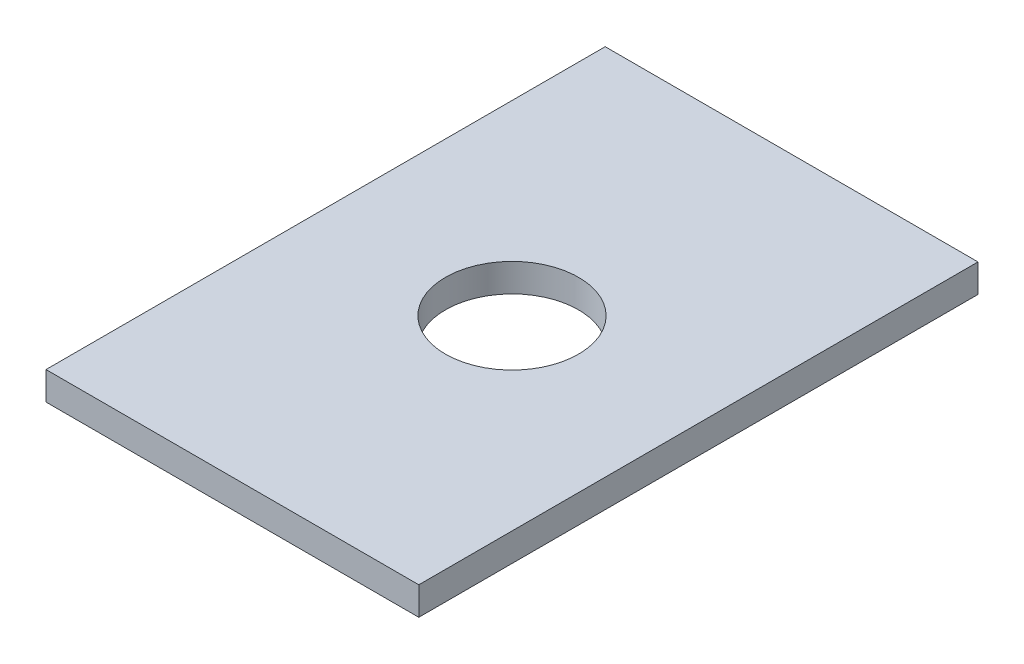
ISO-10303-21;
HEADER;
FILE_DESCRIPTION(('STEP AP214'),'2;1');
FILE_NAME('part.step','',(''),(''),'','','');
FILE_SCHEMA(('AUTOMOTIVE_DESIGN { 1 0 10303 214 1 1 1 1 }'));
ENDSEC;
DATA;
#1=APPLICATION_CONTEXT('core data for automotive mechanical design processes');
#2=APPLICATION_PROTOCOL_DEFINITION('international standard','automotive_design',2000,#1);
#3=PRODUCT_CONTEXT('',#1,'mechanical');
#4=PRODUCT('Part','Part','',(#3));
#5=PRODUCT_RELATED_PRODUCT_CATEGORY('part','',(#4));
#6=PRODUCT_DEFINITION_FORMATION('','',#4);
#7=PRODUCT_DEFINITION_CONTEXT('part definition',#1,'design');
#8=PRODUCT_DEFINITION('design','',#6,#7);
#9=PRODUCT_DEFINITION_SHAPE('','',#8);
#10=(LENGTH_UNIT() NAMED_UNIT(*) SI_UNIT(.MILLI.,.METRE.));
#11=(NAMED_UNIT(*) PLANE_ANGLE_UNIT() SI_UNIT($,.RADIAN.));
#12=(NAMED_UNIT(*) SI_UNIT($,.STERADIAN.) SOLID_ANGLE_UNIT());
#13=UNCERTAINTY_MEASURE_WITH_UNIT(LENGTH_MEASURE(1.E-05),#10,'distance_accuracy_value','');
#14=(GEOMETRIC_REPRESENTATION_CONTEXT(3) GLOBAL_UNCERTAINTY_ASSIGNED_CONTEXT((#13)) GLOBAL_UNIT_ASSIGNED_CONTEXT((#10,
#11,#12)) REPRESENTATION_CONTEXT('',''));
#15=CARTESIAN_POINT('',(0.,0.,0.));
#16=DIRECTION('',(0.,0.,1.));
#17=DIRECTION('',(1.,0.,0.));
#18=AXIS2_PLACEMENT_3D('',#15,#16,#17);
#19=CARTESIAN_POINT('',(0.,3.175,0.));
#20=DIRECTION('',(0.,1.,0.));
#21=DIRECTION('',(0.,0.,1.));
#22=AXIS2_PLACEMENT_3D('',#19,#20,#21);
#23=PLANE('',#22);
#24=DIRECTION('',(0.,0.,-1.));
#25=VECTOR('',#24,1.);
#26=CARTESIAN_POINT('',(21.,3.175,31.5));
#27=LINE('',#26,#25);
#28=CARTESIAN_POINT('',(21.,3.175,31.5));
#29=VERTEX_POINT('',#28);
#30=CARTESIAN_POINT('',(21.,3.175,-31.5));
#31=VERTEX_POINT('',#30);
#32=EDGE_CURVE('E84',#29,#31,#27,.T.);
#33=ORIENTED_EDGE('',*,*,#32,.T.);
#34=DIRECTION('',(-1.,0.,0.));
#35=VECTOR('',#34,1.);
#36=CARTESIAN_POINT('',(21.,3.175,-31.5));
#37=LINE('',#36,#35);
#38=CARTESIAN_POINT('',(-21.,3.175,-31.5));
#39=VERTEX_POINT('',#38);
#40=EDGE_CURVE('E79',#31,#39,#37,.T.);
#41=ORIENTED_EDGE('',*,*,#40,.T.);
#42=DIRECTION('',(0.,0.,1.));
#43=VECTOR('',#42,1.);
#44=CARTESIAN_POINT('',(-21.,3.175,31.5));
#45=LINE('',#44,#43);
#46=CARTESIAN_POINT('',(-21.,3.175,31.5));
#47=VERTEX_POINT('',#46);
#48=EDGE_CURVE('E82',#39,#47,#45,.T.);
#49=ORIENTED_EDGE('',*,*,#48,.T.);
#50=DIRECTION('',(1.,0.,0.));
#51=VECTOR('',#50,1.);
#52=CARTESIAN_POINT('',(21.,3.175,31.5));
#53=LINE('',#52,#51);
#54=EDGE_CURVE('E49',#47,#29,#53,.T.);
#55=ORIENTED_EDGE('',*,*,#54,.T.);
#56=EDGE_LOOP('',(#33,#41,#49,#55));
#57=FACE_BOUND('',#56,.T.);
#58=CARTESIAN_POINT('',(0.,3.175,0.));
#59=DIRECTION('',(0.,1.,0.));
#60=DIRECTION('',(0.,0.,1.));
#61=AXIS2_PLACEMENT_3D('',#58,#59,#60);
#62=CIRCLE('',#61,7.5);
#63=CARTESIAN_POINT('',(0.,3.175,7.5));
#64=VERTEX_POINT('',#63);
#65=EDGE_CURVE('E99',#64,#64,#62,.T.);
#66=ORIENTED_EDGE('',*,*,#65,.F.);
#67=EDGE_LOOP('',(#66));
#68=FACE_BOUND('',#67,.T.);
#69=ADVANCED_FACE('F32',(#57,#68),#23,.T.);
#70=CARTESIAN_POINT('',(0.,0.,0.));
#71=DIRECTION('',(0.,1.,0.));
#72=DIRECTION('',(0.,0.,1.));
#73=AXIS2_PLACEMENT_3D('',#70,#71,#72);
#74=PLANE('',#73);
#75=DIRECTION('',(0.,0.,-1.));
#76=VECTOR('',#75,1.);
#77=CARTESIAN_POINT('',(21.,0.,31.5));
#78=LINE('',#77,#76);
#79=CARTESIAN_POINT('',(21.,0.,31.5));
#80=VERTEX_POINT('',#79);
#81=CARTESIAN_POINT('',(21.,0.,-31.5));
#82=VERTEX_POINT('',#81);
#83=EDGE_CURVE('E96',#80,#82,#78,.T.);
#84=ORIENTED_EDGE('',*,*,#83,.F.);
#85=DIRECTION('',(1.,0.,0.));
#86=VECTOR('',#85,1.);
#87=CARTESIAN_POINT('',(21.,0.,31.5));
#88=LINE('',#87,#86);
#89=CARTESIAN_POINT('',(-21.,0.,31.5));
#90=VERTEX_POINT('',#89);
#91=EDGE_CURVE('E72',#90,#80,#88,.T.);
#92=ORIENTED_EDGE('',*,*,#91,.F.);
#93=DIRECTION('',(0.,0.,1.));
#94=VECTOR('',#93,1.);
#95=CARTESIAN_POINT('',(-21.,0.,31.5));
#96=LINE('',#95,#94);
#97=CARTESIAN_POINT('',(-21.,0.,-31.5));
#98=VERTEX_POINT('',#97);
#99=EDGE_CURVE('E66',#98,#90,#96,.T.);
#100=ORIENTED_EDGE('',*,*,#99,.F.);
#101=DIRECTION('',(-1.,0.,0.));
#102=VECTOR('',#101,1.);
#103=CARTESIAN_POINT('',(21.,0.,-31.5));
#104=LINE('',#103,#102);
#105=EDGE_CURVE('E88',#82,#98,#104,.T.);
#106=ORIENTED_EDGE('',*,*,#105,.F.);
#107=EDGE_LOOP('',(#84,#92,#100,#106));
#108=FACE_BOUND('',#107,.T.);
#109=CARTESIAN_POINT('',(0.,0.,0.));
#110=DIRECTION('',(0.,1.,0.));
#111=DIRECTION('',(0.,0.,1.));
#112=AXIS2_PLACEMENT_3D('',#109,#110,#111);
#113=CIRCLE('',#112,7.5);
#114=CARTESIAN_POINT('',(0.,0.,7.5));
#115=VERTEX_POINT('',#114);
#116=EDGE_CURVE('E111',#115,#115,#113,.T.);
#117=ORIENTED_EDGE('',*,*,#116,.T.);
#118=EDGE_LOOP('',(#117));
#119=FACE_BOUND('',#118,.T.);
#120=ADVANCED_FACE('F107',(#108,#119),#74,.F.);
#121=CARTESIAN_POINT('',(21.,3.175,31.5));
#122=DIRECTION('',(-1.,0.,0.));
#123=DIRECTION('',(0.,0.,1.));
#124=AXIS2_PLACEMENT_3D('',#121,#122,#123);
#125=PLANE('',#124);
#126=ORIENTED_EDGE('',*,*,#83,.T.);
#127=DIRECTION('',(0.,-1.,0.));
#128=VECTOR('',#127,1.);
#129=CARTESIAN_POINT('',(21.,3.175,-31.5));
#130=LINE('',#129,#128);
#131=EDGE_CURVE('E11',#31,#82,#130,.T.);
#132=ORIENTED_EDGE('',*,*,#131,.F.);
#133=ORIENTED_EDGE('',*,*,#32,.F.);
#134=DIRECTION('',(0.,-1.,0.));
#135=VECTOR('',#134,1.);
#136=CARTESIAN_POINT('',(21.,3.175,31.5));
#137=LINE('',#136,#135);
#138=EDGE_CURVE('E92',#29,#80,#137,.T.);
#139=ORIENTED_EDGE('',*,*,#138,.T.);
#140=EDGE_LOOP('',(#126,#132,#133,#139));
#141=FACE_BOUND('',#140,.T.);
#142=ADVANCED_FACE('F34',(#141),#125,.F.);
#143=CARTESIAN_POINT('',(21.,3.175,-31.5));
#144=DIRECTION('',(0.,0.,1.));
#145=DIRECTION('',(1.,0.,0.));
#146=AXIS2_PLACEMENT_3D('',#143,#144,#145);
#147=PLANE('',#146);
#148=ORIENTED_EDGE('',*,*,#105,.T.);
#149=DIRECTION('',(0.,-1.,0.));
#150=VECTOR('',#149,1.);
#151=CARTESIAN_POINT('',(-21.,3.175,-31.5));
#152=LINE('',#151,#150);
#153=EDGE_CURVE('E41',#39,#98,#152,.T.);
#154=ORIENTED_EDGE('',*,*,#153,.F.);
#155=ORIENTED_EDGE('',*,*,#40,.F.);
#156=ORIENTED_EDGE('',*,*,#131,.T.);
#157=EDGE_LOOP('',(#148,#154,#155,#156));
#158=FACE_BOUND('',#157,.T.);
#159=ADVANCED_FACE('F87',(#158),#147,.F.);
#160=CARTESIAN_POINT('',(-21.,3.175,31.5));
#161=DIRECTION('',(1.,0.,0.));
#162=DIRECTION('',(0.,0.,-1.));
#163=AXIS2_PLACEMENT_3D('',#160,#161,#162);
#164=PLANE('',#163);
#165=ORIENTED_EDGE('',*,*,#99,.T.);
#166=DIRECTION('',(0.,-1.,0.));
#167=VECTOR('',#166,1.);
#168=CARTESIAN_POINT('',(-21.,3.175,31.5));
#169=LINE('',#168,#167);
#170=EDGE_CURVE('E89',#47,#90,#169,.T.);
#171=ORIENTED_EDGE('',*,*,#170,.F.);
#172=ORIENTED_EDGE('',*,*,#48,.F.);
#173=ORIENTED_EDGE('',*,*,#153,.T.);
#174=EDGE_LOOP('',(#165,#171,#172,#173));
#175=FACE_BOUND('',#174,.T.);
#176=ADVANCED_FACE('F90',(#175),#164,.F.);
#177=CARTESIAN_POINT('',(21.,3.175,31.5));
#178=DIRECTION('',(0.,0.,-1.));
#179=DIRECTION('',(-1.,0.,0.));
#180=AXIS2_PLACEMENT_3D('',#177,#178,#179);
#181=PLANE('',#180);
#182=ORIENTED_EDGE('',*,*,#91,.T.);
#183=ORIENTED_EDGE('',*,*,#138,.F.);
#184=ORIENTED_EDGE('',*,*,#54,.F.);
#185=ORIENTED_EDGE('',*,*,#170,.T.);
#186=EDGE_LOOP('',(#182,#183,#184,#185));
#187=FACE_BOUND('',#186,.T.);
#188=ADVANCED_FACE('F104',(#187),#181,.F.);
#189=CARTESIAN_POINT('',(0.,3.175,0.));
#190=DIRECTION('',(0.,-1.,0.));
#191=DIRECTION('',(0.,0.,-1.));
#192=AXIS2_PLACEMENT_3D('',#189,#190,#191);
#193=CYLINDRICAL_SURFACE('',#192,7.5);
#194=ORIENTED_EDGE('',*,*,#65,.T.);
#195=EDGE_LOOP('',(#194));
#196=FACE_BOUND('',#195,.T.);
#197=ORIENTED_EDGE('',*,*,#116,.F.);
#198=EDGE_LOOP('',(#197));
#199=FACE_BOUND('',#198,.T.);
#200=ADVANCED_FACE('F117',(#196,#199),#193,.F.);
#201=CLOSED_SHELL('',(#69,#120,#142,#159,#176,#188,#200));
#202=MANIFOLD_SOLID_BREP('B2',#201);
#203=ADVANCED_BREP_SHAPE_REPRESENTATION('',(#18,#202),#14);
#204=SHAPE_DEFINITION_REPRESENTATION(#9,#203);
ENDSEC;
END-ISO-10303-21;
